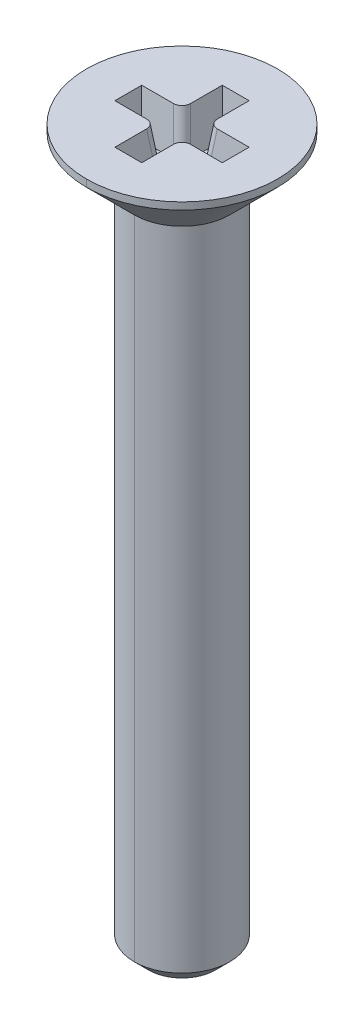
ISO-10303-21;
HEADER;
FILE_DESCRIPTION(('STEP AP214'),'2;1');
FILE_NAME('part.step','',(''),(''),'','','');
FILE_SCHEMA(('AUTOMOTIVE_DESIGN { 1 0 10303 214 1 1 1 1 }'));
ENDSEC;
DATA;
#1=APPLICATION_CONTEXT('core data for automotive mechanical design processes');
#2=APPLICATION_PROTOCOL_DEFINITION('international standard','automotive_design',2000,#1);
#3=PRODUCT_CONTEXT('',#1,'mechanical');
#4=PRODUCT('Part','Part','',(#3));
#5=PRODUCT_RELATED_PRODUCT_CATEGORY('part','',(#4));
#6=PRODUCT_DEFINITION_FORMATION('','',#4);
#7=PRODUCT_DEFINITION_CONTEXT('part definition',#1,'design');
#8=PRODUCT_DEFINITION('design','',#6,#7);
#9=PRODUCT_DEFINITION_SHAPE('','',#8);
#10=(LENGTH_UNIT() NAMED_UNIT(*) SI_UNIT(.MILLI.,.METRE.));
#11=(NAMED_UNIT(*) PLANE_ANGLE_UNIT() SI_UNIT($,.RADIAN.));
#12=(NAMED_UNIT(*) SI_UNIT($,.STERADIAN.) SOLID_ANGLE_UNIT());
#13=UNCERTAINTY_MEASURE_WITH_UNIT(LENGTH_MEASURE(1.E-05),#10,'distance_accuracy_value','');
#14=(GEOMETRIC_REPRESENTATION_CONTEXT(3) GLOBAL_UNCERTAINTY_ASSIGNED_CONTEXT((#13)) GLOBAL_UNIT_ASSIGNED_CONTEXT((#10,
#11,#12)) REPRESENTATION_CONTEXT('',''));
#15=CARTESIAN_POINT('',(0.,0.,0.));
#16=DIRECTION('',(0.,0.,1.));
#17=DIRECTION('',(1.,0.,0.));
#18=AXIS2_PLACEMENT_3D('',#15,#16,#17);
#19=CARTESIAN_POINT('',(-0.937327513708971,2.4151528831535,-0.937327513708973));
#20=DIRECTION('',(-0.120974291151355,0.985256536015293,-0.120974291151355));
#21=DIRECTION('',(0.,0.121869343405148,0.992546151641322));
#22=AXIS2_PLACEMENT_3D('',#19,#20,#21);
#23=CYLINDRICAL_SURFACE('',#22,0.358);
#24=CARTESIAN_POINT('',(-0.3427156359838,0.510000000000022,-0.698047158271395));
#25=CARTESIAN_POINT('',(-0.342715635983799,0.510000000000021,-0.489263624321907));
#26=CARTESIAN_POINT('',(-0.489263624321904,0.510000000000021,-0.342715635983802));
#27=CARTESIAN_POINT('',(-0.698047158271393,0.510000000000022,-0.342715635983802));
#28=(BOUNDED_CURVE() B_SPLINE_CURVE(3,(#24,#25,#26,#27),.UNSPECIFIED.,.F.,
.F.) B_SPLINE_CURVE_WITH_KNOTS((4,4),(2.36362083166487,3.91956447551472),
.UNSPECIFIED.) CURVE() GEOMETRIC_REPRESENTATION_ITEM() RATIONAL_B_SPLINE_CURVE((1.,
0.808225633839927,0.808225633839927,1.)) REPRESENTATION_ITEM(''));
#29=CARTESIAN_POINT('',(-0.3427156359838,0.510000000000022,-0.698047158271395));
#30=VERTEX_POINT('',#29);
#31=CARTESIAN_POINT('',(-0.698047158271393,0.510000000000022,-0.342715635983802));
#32=VERTEX_POINT('',#31);
#33=EDGE_CURVE('E261',#30,#32,#28,.T.);
#34=ORIENTED_EDGE('',*,*,#33,.F.);
#35=DIRECTION('',(0.120974291151355,-0.985256536015293,0.120974291151355));
#36=VECTOR('',#35,1.);
#37=CARTESIAN_POINT('',(-0.3375154376409,0.46764778320126,-0.692846959928494));
#38=LINE('',#37,#36);
#39=CARTESIAN_POINT('',(-0.5625,2.3,-0.917831522287595));
#40=VERTEX_POINT('',#39);
#41=EDGE_CURVE('E262',#40,#30,#38,.T.);
#42=ORIENTED_EDGE('',*,*,#41,.F.);
#43=CARTESIAN_POINT('',(-0.917831522287592,2.3,-0.5625));
#44=CARTESIAN_POINT('',(-0.709047988338105,2.30000000000002,-0.562500000000001));
#45=CARTESIAN_POINT('',(-0.562499999999999,2.30000000000002,-0.709047988338106));
#46=CARTESIAN_POINT('',(-0.5625,2.3,-0.917831522287595));
#47=(BOUNDED_CURVE() B_SPLINE_CURVE(3,(#43,#44,#45,#46),.UNSPECIFIED.,.F.,
.F.) B_SPLINE_CURVE_WITH_KNOTS((4,4),(2.36362083166487,3.91956447551472),
.UNSPECIFIED.) CURVE() GEOMETRIC_REPRESENTATION_ITEM() RATIONAL_B_SPLINE_CURVE((1.,
0.808225633839927,0.808225633839927,1.)) REPRESENTATION_ITEM(''));
#48=CARTESIAN_POINT('',(-0.917831522287592,2.3,-0.5625));
#49=VERTEX_POINT('',#48);
#50=EDGE_CURVE('E307',#49,#40,#47,.T.);
#51=ORIENTED_EDGE('',*,*,#50,.F.);
#52=DIRECTION('',(-0.120974291151355,0.985256536015293,-0.120974291151355));
#53=VECTOR('',#52,1.);
#54=CARTESIAN_POINT('',(-0.912631323944692,2.25764778320126,-0.557299801657101));
#55=LINE('',#54,#53);
#56=EDGE_CURVE('E10',#32,#49,#55,.T.);
#57=ORIENTED_EDGE('',*,*,#56,.F.);
#58=EDGE_LOOP('',(#34,#42,#51,#57));
#59=FACE_BOUND('',#58,.T.);
#60=ADVANCED_FACE('F16',(#59),#23,.T.);
#61=CARTESIAN_POINT('',(-0.871471007670894,1.87879468344341,0.871471007670896));
#62=DIRECTION('',(-0.120974291151355,0.985256536015293,0.120974291151355));
#63=DIRECTION('',(-0.992546151641322,-0.121869343405148,0.));
#64=AXIS2_PLACEMENT_3D('',#61,#62,#63);
#65=CYLINDRICAL_SURFACE('',#64,0.358);
#66=CARTESIAN_POINT('',(-0.698047158271394,0.510000000000022,0.342715635983802));
#67=CARTESIAN_POINT('',(-0.489263624321906,0.510000000000022,0.342715635983801));
#68=CARTESIAN_POINT('',(-0.342715635983801,0.510000000000022,0.489263624321906));
#69=CARTESIAN_POINT('',(-0.342715635983801,0.510000000000022,0.698047158271395));
#70=(BOUNDED_CURVE() B_SPLINE_CURVE(3,(#66,#67,#68,#69),.UNSPECIFIED.,.F.,
.F.) B_SPLINE_CURVE_WITH_KNOTS((4,4),(2.36362083166487,3.91956447551472),
.UNSPECIFIED.) CURVE() GEOMETRIC_REPRESENTATION_ITEM() RATIONAL_B_SPLINE_CURVE((1.,
0.808225633839927,0.808225633839927,1.)) REPRESENTATION_ITEM(''));
#71=CARTESIAN_POINT('',(-0.698047158271394,0.510000000000022,0.342715635983802));
#72=VERTEX_POINT('',#71);
#73=CARTESIAN_POINT('',(-0.342715635983801,0.510000000000022,0.698047158271395));
#74=VERTEX_POINT('',#73);
#75=EDGE_CURVE('E378',#72,#74,#70,.T.);
#76=ORIENTED_EDGE('',*,*,#75,.F.);
#77=DIRECTION('',(0.120974291151355,-0.985256536015293,-0.120974291151355));
#78=VECTOR('',#77,1.);
#79=CARTESIAN_POINT('',(-0.937327513708972,2.45878210809255,0.58199599142138));
#80=LINE('',#79,#78);
#81=CARTESIAN_POINT('',(-0.917831522287593,2.3,0.5625));
#82=VERTEX_POINT('',#81);
#83=EDGE_CURVE('E218',#82,#72,#80,.T.);
#84=ORIENTED_EDGE('',*,*,#83,.F.);
#85=CARTESIAN_POINT('',(-0.5625,2.3,0.917831522287594));
#86=CARTESIAN_POINT('',(-0.5625,2.30000000000002,0.709047988338106));
#87=CARTESIAN_POINT('',(-0.709047988338105,2.30000000000002,0.562500000000001));
#88=CARTESIAN_POINT('',(-0.917831522287593,2.3,0.5625));
#89=(BOUNDED_CURVE() B_SPLINE_CURVE(3,(#85,#86,#87,#88),.UNSPECIFIED.,.F.,
.F.) B_SPLINE_CURVE_WITH_KNOTS((4,4),(2.36362083166487,3.91956447551472),
.UNSPECIFIED.) CURVE() GEOMETRIC_REPRESENTATION_ITEM() RATIONAL_B_SPLINE_CURVE((1.,
0.808225633839927,0.808225633839927,1.)) REPRESENTATION_ITEM(''));
#90=CARTESIAN_POINT('',(-0.5625,2.3,0.917831522287594));
#91=VERTEX_POINT('',#90);
#92=EDGE_CURVE('E292',#91,#82,#89,.T.);
#93=ORIENTED_EDGE('',*,*,#92,.F.);
#94=DIRECTION('',(-0.120974291151355,0.985256536015293,0.120974291151355));
#95=VECTOR('',#94,1.);
#96=CARTESIAN_POINT('',(-0.516139485383301,1.92242390838245,0.871471007670896));
#97=LINE('',#96,#95);
#98=EDGE_CURVE('E350',#74,#91,#97,.T.);
#99=ORIENTED_EDGE('',*,*,#98,.F.);
#100=EDGE_LOOP('',(#76,#84,#93,#99));
#101=FACE_BOUND('',#100,.T.);
#102=ADVANCED_FACE('F18',(#101),#65,.T.);
#103=CARTESIAN_POINT('',(0.871471007670896,1.87879468344341,0.871471007670895));
#104=DIRECTION('',(0.120974291151355,0.985256536015293,0.120974291151355));
#105=DIRECTION('',(-0.992546151641322,0.121869343405148,0.));
#106=AXIS2_PLACEMENT_3D('',#103,#104,#105);
#107=CYLINDRICAL_SURFACE('',#106,0.358);
#108=CARTESIAN_POINT('',(0.342715635983802,0.510000000000022,0.698047158271395));
#109=CARTESIAN_POINT('',(0.342715635983802,0.510000000000022,0.489263624321907));
#110=CARTESIAN_POINT('',(0.489263624321907,0.510000000000022,0.342715635983802));
#111=CARTESIAN_POINT('',(0.698047158271395,0.510000000000022,0.342715635983802));
#112=(BOUNDED_CURVE() B_SPLINE_CURVE(3,(#108,#109,#110,#111),.UNSPECIFIED.,.F.,
.F.) B_SPLINE_CURVE_WITH_KNOTS((4,4),(2.36362083166487,3.91956447551472),
.UNSPECIFIED.) CURVE() GEOMETRIC_REPRESENTATION_ITEM() RATIONAL_B_SPLINE_CURVE((1.,
0.808225633839927,0.808225633839927,1.)) REPRESENTATION_ITEM(''));
#113=CARTESIAN_POINT('',(0.342715635983802,0.510000000000022,0.698047158271395));
#114=VERTEX_POINT('',#113);
#115=CARTESIAN_POINT('',(0.698047158271395,0.510000000000022,0.342715635983802));
#116=VERTEX_POINT('',#115);
#117=EDGE_CURVE('E379',#114,#116,#112,.T.);
#118=ORIENTED_EDGE('',*,*,#117,.F.);
#119=DIRECTION('',(-0.120974291151355,-0.985256536015293,-0.120974291151355));
#120=VECTOR('',#119,1.);
#121=CARTESIAN_POINT('',(0.337515437640901,0.46764778320126,0.692846959928494));
#122=LINE('',#121,#120);
#123=CARTESIAN_POINT('',(0.5625,2.3,0.917831522287594));
#124=VERTEX_POINT('',#123);
#125=EDGE_CURVE('E281',#124,#114,#122,.T.);
#126=ORIENTED_EDGE('',*,*,#125,.F.);
#127=CARTESIAN_POINT('',(0.917831522287594,2.3,0.5625));
#128=CARTESIAN_POINT('',(0.709047988338106,2.30000000000002,0.562500000000001));
#129=CARTESIAN_POINT('',(0.562500000000001,2.30000000000002,0.709047988338106));
#130=CARTESIAN_POINT('',(0.5625,2.3,0.917831522287594));
#131=(BOUNDED_CURVE() B_SPLINE_CURVE(3,(#127,#128,#129,#130),.UNSPECIFIED.,.F.,
.F.) B_SPLINE_CURVE_WITH_KNOTS((4,4),(2.36362083166487,3.91956447551472),
.UNSPECIFIED.) CURVE() GEOMETRIC_REPRESENTATION_ITEM() RATIONAL_B_SPLINE_CURVE((1.,
0.808225633839927,0.808225633839927,1.)) REPRESENTATION_ITEM(''));
#132=CARTESIAN_POINT('',(0.917831522287594,2.3,0.5625));
#133=VERTEX_POINT('',#132);
#134=EDGE_CURVE('E255',#133,#124,#131,.T.);
#135=ORIENTED_EDGE('',*,*,#134,.F.);
#136=DIRECTION('',(0.120974291151355,0.985256536015293,0.120974291151355));
#137=VECTOR('',#136,1.);
#138=CARTESIAN_POINT('',(0.912631323944694,2.25764778320126,0.557299801657101));
#139=LINE('',#138,#137);
#140=EDGE_CURVE('E219',#116,#133,#139,.T.);
#141=ORIENTED_EDGE('',*,*,#140,.F.);
#142=EDGE_LOOP('',(#118,#126,#135,#141));
#143=FACE_BOUND('',#142,.T.);
#144=ADVANCED_FACE('F923',(#143),#107,.T.);
#145=CARTESIAN_POINT('',(0.937327513708973,2.4151528831535,-0.937327513708973));
#146=DIRECTION('',(0.120974291151355,0.985256536015293,-0.120974291151355));
#147=DIRECTION('',(0.,0.121869343405148,0.992546151641322));
#148=AXIS2_PLACEMENT_3D('',#145,#146,#147);
#149=CYLINDRICAL_SURFACE('',#148,0.358);
#150=CARTESIAN_POINT('',(0.698047158271395,0.510000000000022,-0.342715635983802));
#151=CARTESIAN_POINT('',(0.489263624321907,0.510000000000021,-0.342715635983801));
#152=CARTESIAN_POINT('',(0.342715635983801,0.510000000000021,-0.489263624321907));
#153=CARTESIAN_POINT('',(0.342715635983802,0.510000000000022,-0.698047158271395));
#154=(BOUNDED_CURVE() B_SPLINE_CURVE(3,(#150,#151,#152,#153),.UNSPECIFIED.,.F.,
.F.) B_SPLINE_CURVE_WITH_KNOTS((4,4),(2.36362083166487,3.91956447551472),
.UNSPECIFIED.) CURVE() GEOMETRIC_REPRESENTATION_ITEM() RATIONAL_B_SPLINE_CURVE((1.,
0.808225633839927,0.808225633839927,1.)) REPRESENTATION_ITEM(''));
#155=CARTESIAN_POINT('',(0.698047158271395,0.510000000000022,-0.342715635983802));
#156=VERTEX_POINT('',#155);
#157=CARTESIAN_POINT('',(0.342715635983802,0.510000000000022,-0.698047158271395));
#158=VERTEX_POINT('',#157);
#159=EDGE_CURVE('E215',#156,#158,#154,.T.);
#160=ORIENTED_EDGE('',*,*,#159,.F.);
#161=DIRECTION('',(-0.120974291151355,-0.985256536015293,0.120974291151355));
#162=VECTOR('',#161,1.);
#163=CARTESIAN_POINT('',(0.871471007670895,1.92242390838245,-0.516139485383302));
#164=LINE('',#163,#162);
#165=CARTESIAN_POINT('',(0.917831522287594,2.3,-0.5625));
#166=VERTEX_POINT('',#165);
#167=EDGE_CURVE('E38',#166,#156,#164,.T.);
#168=ORIENTED_EDGE('',*,*,#167,.F.);
#169=CARTESIAN_POINT('',(0.5625,2.3,-0.917831522287594));
#170=CARTESIAN_POINT('',(0.562500000000001,2.30000000000002,-0.709047988338106));
#171=CARTESIAN_POINT('',(0.709047988338106,2.30000000000002,-0.562500000000001));
#172=CARTESIAN_POINT('',(0.917831522287594,2.3,-0.5625));
#173=(BOUNDED_CURVE() B_SPLINE_CURVE(3,(#169,#170,#171,#172),.UNSPECIFIED.,.F.,
.F.) B_SPLINE_CURVE_WITH_KNOTS((4,4),(2.36362083166487,3.91956447551472),
.UNSPECIFIED.) CURVE() GEOMETRIC_REPRESENTATION_ITEM() RATIONAL_B_SPLINE_CURVE((1.,
0.808225633839927,0.808225633839927,1.)) REPRESENTATION_ITEM(''));
#174=CARTESIAN_POINT('',(0.5625,2.3,-0.917831522287594));
#175=VERTEX_POINT('',#174);
#176=EDGE_CURVE('E213',#175,#166,#173,.T.);
#177=ORIENTED_EDGE('',*,*,#176,.F.);
#178=DIRECTION('',(0.120974291151355,0.985256536015293,-0.120974291151355));
#179=VECTOR('',#178,1.);
#180=CARTESIAN_POINT('',(0.58199599142138,2.45878210809255,-0.937327513708973));
#181=LINE('',#180,#179);
#182=EDGE_CURVE('E337',#158,#175,#181,.T.);
#183=ORIENTED_EDGE('',*,*,#182,.F.);
#184=EDGE_LOOP('',(#160,#168,#177,#183));
#185=FACE_BOUND('',#184,.T.);
#186=ADVANCED_FACE('F210',(#185),#149,.T.);
#187=CARTESIAN_POINT('',(0.,-27.1,0.));
#188=DIRECTION('',(0.,1.,0.));
#189=DIRECTION('',(0.,0.,1.));
#190=AXIS2_PLACEMENT_3D('',#187,#188,#189);
#191=CONICAL_SURFACE('',#190,2.,0.785398163397457);
#192=DIRECTION('',(0.,0.707106781186542,-0.707106781186554));
#193=VECTOR('',#192,1.);
#194=CARTESIAN_POINT('',(0.,-27.1,-2.));
#195=LINE('',#194,#193);
#196=CARTESIAN_POINT('',(0.,-27.7,-1.4));
#197=VERTEX_POINT('',#196);
#198=CARTESIAN_POINT('',(0.,-27.1,-2.));
#199=VERTEX_POINT('',#198);
#200=EDGE_CURVE('E421',#197,#199,#195,.T.);
#201=ORIENTED_EDGE('',*,*,#200,.F.);
#202=CARTESIAN_POINT('',(0.,-27.7,0.));
#203=DIRECTION('',(0.,-1.,0.));
#204=DIRECTION('',(0.,0.,1.));
#205=AXIS2_PLACEMENT_3D('',#202,#203,#204);
#206=CIRCLE('',#205,1.4);
#207=CARTESIAN_POINT('',(0.,-27.7,1.4));
#208=VERTEX_POINT('',#207);
#209=EDGE_CURVE('E278',#208,#197,#206,.T.);
#210=ORIENTED_EDGE('',*,*,#209,.F.);
#211=DIRECTION('',(0.,0.707106781186542,0.707106781186554));
#212=VECTOR('',#211,1.);
#213=CARTESIAN_POINT('',(0.,-27.1,2.));
#214=LINE('',#213,#212);
#215=CARTESIAN_POINT('',(0.,-27.1,2.));
#216=VERTEX_POINT('',#215);
#217=EDGE_CURVE('E428',#208,#216,#214,.T.);
#218=ORIENTED_EDGE('',*,*,#217,.T.);
#219=CARTESIAN_POINT('',(0.,-27.1,0.));
#220=DIRECTION('',(0.,1.,0.));
#221=DIRECTION('',(0.,0.,1.));
#222=AXIS2_PLACEMENT_3D('',#219,#220,#221);
#223=CIRCLE('',#222,2.);
#224=EDGE_CURVE('E282',#199,#216,#223,.T.);
#225=ORIENTED_EDGE('',*,*,#224,.F.);
#226=EDGE_LOOP('',(#201,#210,#218,#225));
#227=FACE_BOUND('',#226,.T.);
#228=ADVANCED_FACE('F527',(#227),#191,.T.);
#229=CARTESIAN_POINT('',(-2.25,2.3,-0.5625));
#230=DIRECTION('',(0.,-0.121869343405148,-0.992546151641322));
#231=DIRECTION('',(0.,-0.992546151641322,0.121869343405148));
#232=AXIS2_PLACEMENT_3D('',#229,#230,#231);
#233=PLANE('',#232);
#234=DIRECTION('',(1.,0.,0.));
#235=VECTOR('',#234,1.);
#236=CARTESIAN_POINT('',(-2.25,0.510000000000022,-0.342715635983802));
#237=LINE('',#236,#235);
#238=CARTESIAN_POINT('',(-2.0302156359838,0.510000000000022,-0.342715635983802));
#239=VERTEX_POINT('',#238);
#240=EDGE_CURVE('E366',#239,#32,#237,.T.);
#241=ORIENTED_EDGE('',*,*,#240,.T.);
#242=ORIENTED_EDGE('',*,*,#56,.T.);
#243=DIRECTION('',(1.,0.,0.));
#244=VECTOR('',#243,1.);
#245=CARTESIAN_POINT('',(-2.25,2.3,-0.5625));
#246=LINE('',#245,#244);
#247=CARTESIAN_POINT('',(-2.25,2.3,-0.5625));
#248=VERTEX_POINT('',#247);
#249=EDGE_CURVE('E287',#248,#49,#246,.T.);
#250=ORIENTED_EDGE('',*,*,#249,.F.);
#251=DIRECTION('',(-0.120974291151354,0.985256536015293,-0.120974291151355));
#252=VECTOR('',#251,1.);
#253=CARTESIAN_POINT('',(-2.25,2.3,-0.5625));
#254=LINE('',#253,#252);
#255=EDGE_CURVE('E25',#239,#248,#254,.T.);
#256=ORIENTED_EDGE('',*,*,#255,.F.);
#257=EDGE_LOOP('',(#241,#242,#250,#256));
#258=FACE_BOUND('',#257,.T.);
#259=ADVANCED_FACE('F899',(#258),#233,.F.);
#260=CARTESIAN_POINT('',(-2.25,2.3,-0.5625));
#261=DIRECTION('',(-0.992546151641322,-0.121869343405148,0.));
#262=DIRECTION('',(-0.121869343405148,0.992546151641322,0.));
#263=AXIS2_PLACEMENT_3D('',#260,#261,#262);
#264=PLANE('',#263);
#265=DIRECTION('',(0.,0.,1.));
#266=VECTOR('',#265,1.);
#267=CARTESIAN_POINT('',(-2.25,2.3,-0.5625));
#268=LINE('',#267,#266);
#269=CARTESIAN_POINT('',(-2.25,2.3,0.5625));
#270=VERTEX_POINT('',#269);
#271=EDGE_CURVE('E283',#248,#270,#268,.T.);
#272=ORIENTED_EDGE('',*,*,#271,.T.);
#273=DIRECTION('',(-0.120974291151356,0.985256536015293,0.120974291151355));
#274=VECTOR('',#273,1.);
#275=CARTESIAN_POINT('',(-2.23353587349048,2.1659104500725,0.546035873490482));
#276=LINE('',#275,#274);
#277=CARTESIAN_POINT('',(-2.0302156359838,0.510000000000022,0.342715635983802));
#278=VERTEX_POINT('',#277);
#279=EDGE_CURVE('E404',#278,#270,#276,.T.);
#280=ORIENTED_EDGE('',*,*,#279,.F.);
#281=DIRECTION('',(0.,0.,1.));
#282=VECTOR('',#281,1.);
#283=CARTESIAN_POINT('',(-2.0302156359838,0.510000000000022,-0.5625));
#284=LINE('',#283,#282);
#285=EDGE_CURVE('E370',#239,#278,#284,.T.);
#286=ORIENTED_EDGE('',*,*,#285,.F.);
#287=ORIENTED_EDGE('',*,*,#255,.T.);
#288=EDGE_LOOP('',(#272,#280,#286,#287));
#289=FACE_BOUND('',#288,.T.);
#290=ADVANCED_FACE('F774',(#289),#264,.F.);
#291=CARTESIAN_POINT('',(-2.25,2.3,0.5625));
#292=DIRECTION('',(0.,-0.121869343405148,0.992546151641322));
#293=DIRECTION('',(-1.,0.,0.));
#294=AXIS2_PLACEMENT_3D('',#291,#292,#293);
#295=PLANE('',#294);
#296=DIRECTION('',(1.,0.,0.));
#297=VECTOR('',#296,1.);
#298=CARTESIAN_POINT('',(-2.25,2.3,0.5625));
#299=LINE('',#298,#297);
#300=EDGE_CURVE('E288',#270,#82,#299,.T.);
#301=ORIENTED_EDGE('',*,*,#300,.T.);
#302=ORIENTED_EDGE('',*,*,#83,.T.);
#303=DIRECTION('',(1.,0.,0.));
#304=VECTOR('',#303,1.);
#305=CARTESIAN_POINT('',(-2.25,0.510000000000022,0.342715635983802));
#306=LINE('',#305,#304);
#307=EDGE_CURVE('E374',#278,#72,#306,.T.);
#308=ORIENTED_EDGE('',*,*,#307,.F.);
#309=ORIENTED_EDGE('',*,*,#279,.T.);
#310=EDGE_LOOP('',(#301,#302,#308,#309));
#311=FACE_BOUND('',#310,.T.);
#312=ADVANCED_FACE('F770',(#311),#295,.F.);
#313=CARTESIAN_POINT('',(-2.25,2.3,-0.5625));
#314=DIRECTION('',(0.,-0.121869343405148,-0.992546151641322));
#315=DIRECTION('',(0.,-0.992546151641322,0.121869343405148));
#316=AXIS2_PLACEMENT_3D('',#313,#314,#315);
#317=PLANE('',#316);
#318=DIRECTION('',(1.,0.,0.));
#319=VECTOR('',#318,1.);
#320=CARTESIAN_POINT('',(-2.25,2.3,-0.5625));
#321=LINE('',#320,#319);
#322=CARTESIAN_POINT('',(2.25,2.3,-0.5625));
#323=VERTEX_POINT('',#322);
#324=EDGE_CURVE('E222',#166,#323,#321,.T.);
#325=ORIENTED_EDGE('',*,*,#324,.F.);
#326=ORIENTED_EDGE('',*,*,#167,.T.);
#327=DIRECTION('',(1.,0.,0.));
#328=VECTOR('',#327,1.);
#329=CARTESIAN_POINT('',(-2.25,0.510000000000022,-0.342715635983802));
#330=LINE('',#329,#328);
#331=CARTESIAN_POINT('',(2.0302156359838,0.510000000000022,-0.342715635983802));
#332=VERTEX_POINT('',#331);
#333=EDGE_CURVE('E328',#156,#332,#330,.T.);
#334=ORIENTED_EDGE('',*,*,#333,.T.);
#335=DIRECTION('',(0.120974291151354,0.985256536015293,-0.120974291151355));
#336=VECTOR('',#335,1.);
#337=CARTESIAN_POINT('',(2.25,2.3,-0.5625));
#338=LINE('',#337,#336);
#339=EDGE_CURVE('E49',#332,#323,#338,.T.);
#340=ORIENTED_EDGE('',*,*,#339,.T.);
#341=EDGE_LOOP('',(#325,#326,#334,#340));
#342=FACE_BOUND('',#341,.T.);
#343=ADVANCED_FACE('F223',(#342),#317,.F.);
#344=CARTESIAN_POINT('',(-2.25,2.3,0.5625));
#345=DIRECTION('',(0.,-0.121869343405148,0.992546151641322));
#346=DIRECTION('',(-1.,0.,0.));
#347=AXIS2_PLACEMENT_3D('',#344,#345,#346);
#348=PLANE('',#347);
#349=DIRECTION('',(1.,0.,0.));
#350=VECTOR('',#349,1.);
#351=CARTESIAN_POINT('',(-2.25,0.510000000000022,0.342715635983802));
#352=LINE('',#351,#350);
#353=CARTESIAN_POINT('',(2.0302156359838,0.510000000000022,0.342715635983802));
#354=VERTEX_POINT('',#353);
#355=EDGE_CURVE('E385',#116,#354,#352,.T.);
#356=ORIENTED_EDGE('',*,*,#355,.F.);
#357=ORIENTED_EDGE('',*,*,#140,.T.);
#358=DIRECTION('',(1.,0.,0.));
#359=VECTOR('',#358,1.);
#360=CARTESIAN_POINT('',(-2.25,2.3,0.5625));
#361=LINE('',#360,#359);
#362=CARTESIAN_POINT('',(2.25,2.3,0.5625));
#363=VERTEX_POINT('',#362);
#364=EDGE_CURVE('E265',#133,#363,#361,.T.);
#365=ORIENTED_EDGE('',*,*,#364,.T.);
#366=DIRECTION('',(0.120974291151355,0.985256536015293,0.120974291151355));
#367=VECTOR('',#366,1.);
#368=CARTESIAN_POINT('',(2.23353587349048,2.1659104500725,0.546035873490482));
#369=LINE('',#368,#367);
#370=EDGE_CURVE('E399',#354,#363,#369,.T.);
#371=ORIENTED_EDGE('',*,*,#370,.F.);
#372=EDGE_LOOP('',(#356,#357,#365,#371));
#373=FACE_BOUND('',#372,.T.);
#374=ADVANCED_FACE('F868',(#373),#348,.F.);
#375=CARTESIAN_POINT('',(2.25,2.3,-0.5625));
#376=DIRECTION('',(0.992546151641322,-0.121869343405148,0.));
#377=DIRECTION('',(0.,0.,-1.));
#378=AXIS2_PLACEMENT_3D('',#375,#376,#377);
#379=PLANE('',#378);
#380=DIRECTION('',(0.,0.,1.));
#381=VECTOR('',#380,1.);
#382=CARTESIAN_POINT('',(2.25,2.3,-0.5625));
#383=LINE('',#382,#381);
#384=EDGE_CURVE('E227',#323,#363,#383,.T.);
#385=ORIENTED_EDGE('',*,*,#384,.F.);
#386=ORIENTED_EDGE('',*,*,#339,.F.);
#387=DIRECTION('',(0.,0.,1.));
#388=VECTOR('',#387,1.);
#389=CARTESIAN_POINT('',(2.0302156359838,0.510000000000022,-0.5625));
#390=LINE('',#389,#388);
#391=EDGE_CURVE('E392',#332,#354,#390,.T.);
#392=ORIENTED_EDGE('',*,*,#391,.T.);
#393=ORIENTED_EDGE('',*,*,#370,.T.);
#394=EDGE_LOOP('',(#385,#386,#392,#393));
#395=FACE_BOUND('',#394,.T.);
#396=ADVANCED_FACE('F859',(#395),#379,.F.);
#397=CARTESIAN_POINT('',(0.5625,0.510000000000022,-2.25));
#398=DIRECTION('',(0.,-1.,0.));
#399=DIRECTION('',(0.,0.,-1.));
#400=AXIS2_PLACEMENT_3D('',#397,#398,#399);
#401=PLANE('',#400);
#402=DIRECTION('',(0.,0.,1.));
#403=VECTOR('',#402,1.);
#404=CARTESIAN_POINT('',(0.342715635983801,0.510000000000022,-2.25));
#405=LINE('',#404,#403);
#406=CARTESIAN_POINT('',(0.342715635983801,0.510000000000022,-2.0302156359838));
#407=VERTEX_POINT('',#406);
#408=EDGE_CURVE('E363',#407,#158,#405,.T.);
#409=ORIENTED_EDGE('',*,*,#408,.F.);
#410=DIRECTION('',(1.,0.,0.));
#411=VECTOR('',#410,1.);
#412=CARTESIAN_POINT('',(-0.5625,0.510000000000022,-2.0302156359838));
#413=LINE('',#412,#411);
#414=CARTESIAN_POINT('',(-0.3427156359838,0.510000000000022,-2.0302156359838));
#415=VERTEX_POINT('',#414);
#416=EDGE_CURVE('E356',#415,#407,#413,.T.);
#417=ORIENTED_EDGE('',*,*,#416,.F.);
#418=DIRECTION('',(0.,0.,1.));
#419=VECTOR('',#418,1.);
#420=CARTESIAN_POINT('',(-0.3427156359838,0.510000000000022,-2.25));
#421=LINE('',#420,#419);
#422=EDGE_CURVE('E257',#415,#30,#421,.T.);
#423=ORIENTED_EDGE('',*,*,#422,.T.);
#424=ORIENTED_EDGE('',*,*,#33,.T.);
#425=ORIENTED_EDGE('',*,*,#240,.F.);
#426=ORIENTED_EDGE('',*,*,#285,.T.);
#427=ORIENTED_EDGE('',*,*,#307,.T.);
#428=ORIENTED_EDGE('',*,*,#75,.T.);
#429=DIRECTION('',(0.,0.,1.));
#430=VECTOR('',#429,1.);
#431=CARTESIAN_POINT('',(-0.3427156359838,0.510000000000022,-2.25));
#432=LINE('',#431,#430);
#433=CARTESIAN_POINT('',(-0.342715635983801,0.510000000000022,2.0302156359838));
#434=VERTEX_POINT('',#433);
#435=EDGE_CURVE('E346',#74,#434,#432,.T.);
#436=ORIENTED_EDGE('',*,*,#435,.T.);
#437=DIRECTION('',(1.,0.,0.));
#438=VECTOR('',#437,1.);
#439=CARTESIAN_POINT('',(-0.5625,0.510000000000022,2.0302156359838));
#440=LINE('',#439,#438);
#441=CARTESIAN_POINT('',(0.342715635983802,0.510000000000022,2.0302156359838));
#442=VERTEX_POINT('',#441);
#443=EDGE_CURVE('E347',#434,#442,#440,.T.);
#444=ORIENTED_EDGE('',*,*,#443,.T.);
#445=DIRECTION('',(0.,0.,1.));
#446=VECTOR('',#445,1.);
#447=CARTESIAN_POINT('',(0.342715635983801,0.510000000000022,-2.25));
#448=LINE('',#447,#446);
#449=EDGE_CURVE('E308',#114,#442,#448,.T.);
#450=ORIENTED_EDGE('',*,*,#449,.F.);
#451=ORIENTED_EDGE('',*,*,#117,.T.);
#452=ORIENTED_EDGE('',*,*,#355,.T.);
#453=ORIENTED_EDGE('',*,*,#391,.F.);
#454=ORIENTED_EDGE('',*,*,#333,.F.);
#455=ORIENTED_EDGE('',*,*,#159,.T.);
#456=EDGE_LOOP('',(#409,#417,#423,#424,#425,#426,#427,#428,#436,#444,#450,#451,#452,#453,#454,#455));
#457=FACE_BOUND('',#456,.T.);
#458=ADVANCED_FACE('F842',(#457),#401,.F.);
#459=CARTESIAN_POINT('',(-0.5625,2.3,-2.25));
#460=DIRECTION('',(-0.992546151641322,-0.121869343405148,0.));
#461=DIRECTION('',(-0.121869343405148,0.992546151641322,0.));
#462=AXIS2_PLACEMENT_3D('',#459,#460,#461);
#463=PLANE('',#462);
#464=DIRECTION('',(0.,0.,1.));
#465=VECTOR('',#464,1.);
#466=CARTESIAN_POINT('',(-0.5625,2.3,-2.25));
#467=LINE('',#466,#465);
#468=CARTESIAN_POINT('',(-0.5625,2.3,-2.25));
#469=VERTEX_POINT('',#468);
#470=EDGE_CURVE('E273',#469,#40,#467,.T.);
#471=ORIENTED_EDGE('',*,*,#470,.T.);
#472=ORIENTED_EDGE('',*,*,#41,.T.);
#473=ORIENTED_EDGE('',*,*,#422,.F.);
#474=DIRECTION('',(-0.120974291151355,0.985256536015293,-0.120974291151355));
#475=VECTOR('',#474,1.);
#476=CARTESIAN_POINT('',(-0.5625,2.3,-2.25));
#477=LINE('',#476,#475);
#478=EDGE_CURVE('E353',#415,#469,#477,.T.);
#479=ORIENTED_EDGE('',*,*,#478,.T.);
#480=EDGE_LOOP('',(#471,#472,#473,#479));
#481=FACE_BOUND('',#480,.T.);
#482=ADVANCED_FACE('F733',(#481),#463,.F.);
#483=CARTESIAN_POINT('',(0.5625,2.3,-2.25));
#484=DIRECTION('',(0.992546151641322,-0.121869343405148,0.));
#485=DIRECTION('',(0.,0.,-1.));
#486=AXIS2_PLACEMENT_3D('',#483,#484,#485);
#487=PLANE('',#486);
#488=ORIENTED_EDGE('',*,*,#408,.T.);
#489=ORIENTED_EDGE('',*,*,#182,.T.);
#490=DIRECTION('',(0.,0.,1.));
#491=VECTOR('',#490,1.);
#492=CARTESIAN_POINT('',(0.5625,2.3,-2.25));
#493=LINE('',#492,#491);
#494=CARTESIAN_POINT('',(0.5625,2.3,-2.25));
#495=VERTEX_POINT('',#494);
#496=EDGE_CURVE('E233',#495,#175,#493,.T.);
#497=ORIENTED_EDGE('',*,*,#496,.F.);
#498=DIRECTION('',(0.120974291151355,0.985256536015293,-0.120974291151355));
#499=VECTOR('',#498,1.);
#500=CARTESIAN_POINT('',(0.5625,2.3,-2.25));
#501=LINE('',#500,#499);
#502=EDGE_CURVE('E360',#407,#495,#501,.T.);
#503=ORIENTED_EDGE('',*,*,#502,.F.);
#504=EDGE_LOOP('',(#488,#489,#497,#503));
#505=FACE_BOUND('',#504,.T.);
#506=ADVANCED_FACE('F728',(#505),#487,.F.);
#507=CARTESIAN_POINT('',(-0.5625,2.3,-2.25));
#508=DIRECTION('',(0.,-0.121869343405148,-0.992546151641322));
#509=DIRECTION('',(0.,-0.992546151641322,0.121869343405148));
#510=AXIS2_PLACEMENT_3D('',#507,#508,#509);
#511=PLANE('',#510);
#512=DIRECTION('',(1.,0.,0.));
#513=VECTOR('',#512,1.);
#514=CARTESIAN_POINT('',(-0.5625,2.3,-2.25));
#515=LINE('',#514,#513);
#516=EDGE_CURVE('E269',#469,#495,#515,.T.);
#517=ORIENTED_EDGE('',*,*,#516,.F.);
#518=ORIENTED_EDGE('',*,*,#478,.F.);
#519=ORIENTED_EDGE('',*,*,#416,.T.);
#520=ORIENTED_EDGE('',*,*,#502,.T.);
#521=EDGE_LOOP('',(#517,#518,#519,#520));
#522=FACE_BOUND('',#521,.T.);
#523=ADVANCED_FACE('F732',(#522),#511,.F.);
#524=CARTESIAN_POINT('',(-0.5625,2.3,-2.25));
#525=DIRECTION('',(-0.992546151641322,-0.121869343405148,0.));
#526=DIRECTION('',(-0.121869343405148,0.992546151641322,0.));
#527=AXIS2_PLACEMENT_3D('',#524,#525,#526);
#528=PLANE('',#527);
#529=ORIENTED_EDGE('',*,*,#435,.F.);
#530=ORIENTED_EDGE('',*,*,#98,.T.);
#531=DIRECTION('',(0.,0.,1.));
#532=VECTOR('',#531,1.);
#533=CARTESIAN_POINT('',(-0.5625,2.3,-2.25));
#534=LINE('',#533,#532);
#535=CARTESIAN_POINT('',(-0.5625,2.3,2.25));
#536=VERTEX_POINT('',#535);
#537=EDGE_CURVE('E277',#91,#536,#534,.T.);
#538=ORIENTED_EDGE('',*,*,#537,.T.);
#539=DIRECTION('',(-0.120974291151355,0.985256536015293,0.120974291151355));
#540=VECTOR('',#539,1.);
#541=CARTESIAN_POINT('',(-0.496643493961923,1.76364180028992,2.18414349396192));
#542=LINE('',#541,#540);
#543=EDGE_CURVE('E343',#434,#536,#542,.T.);
#544=ORIENTED_EDGE('',*,*,#543,.F.);
#545=EDGE_LOOP('',(#529,#530,#538,#544));
#546=FACE_BOUND('',#545,.T.);
#547=ADVANCED_FACE('F739',(#546),#528,.F.);
#548=CARTESIAN_POINT('',(-0.5625,2.3,2.25));
#549=DIRECTION('',(0.,-0.121869343405148,0.992546151641322));
#550=DIRECTION('',(-1.,0.,0.));
#551=AXIS2_PLACEMENT_3D('',#548,#549,#550);
#552=PLANE('',#551);
#553=DIRECTION('',(1.,0.,0.));
#554=VECTOR('',#553,1.);
#555=CARTESIAN_POINT('',(-0.5625,2.3,2.25));
#556=LINE('',#555,#554);
#557=CARTESIAN_POINT('',(0.5625,2.3,2.25));
#558=VERTEX_POINT('',#557);
#559=EDGE_CURVE('E254',#536,#558,#556,.T.);
#560=ORIENTED_EDGE('',*,*,#559,.T.);
#561=DIRECTION('',(0.120974291151355,0.985256536015293,0.120974291151355));
#562=VECTOR('',#561,1.);
#563=CARTESIAN_POINT('',(0.496643493961924,1.76364180028992,2.18414349396192));
#564=LINE('',#563,#562);
#565=EDGE_CURVE('E312',#442,#558,#564,.T.);
#566=ORIENTED_EDGE('',*,*,#565,.F.);
#567=ORIENTED_EDGE('',*,*,#443,.F.);
#568=ORIENTED_EDGE('',*,*,#543,.T.);
#569=EDGE_LOOP('',(#560,#566,#567,#568));
#570=FACE_BOUND('',#569,.T.);
#571=ADVANCED_FACE('F743',(#570),#552,.F.);
#572=CARTESIAN_POINT('',(0.5625,2.3,-2.25));
#573=DIRECTION('',(0.992546151641322,-0.121869343405148,0.));
#574=DIRECTION('',(0.,0.,-1.));
#575=AXIS2_PLACEMENT_3D('',#572,#573,#574);
#576=PLANE('',#575);
#577=DIRECTION('',(0.,0.,1.));
#578=VECTOR('',#577,1.);
#579=CARTESIAN_POINT('',(0.5625,2.3,-2.25));
#580=LINE('',#579,#578);
#581=EDGE_CURVE('E249',#124,#558,#580,.T.);
#582=ORIENTED_EDGE('',*,*,#581,.F.);
#583=ORIENTED_EDGE('',*,*,#125,.T.);
#584=ORIENTED_EDGE('',*,*,#449,.T.);
#585=ORIENTED_EDGE('',*,*,#565,.T.);
#586=EDGE_LOOP('',(#582,#583,#584,#585));
#587=FACE_BOUND('',#586,.T.);
#588=ADVANCED_FACE('F796',(#587),#576,.F.);
#589=CARTESIAN_POINT('',(2.,-27.7,0.));
#590=DIRECTION('',(0.,1.,0.));
#591=DIRECTION('',(1.,0.,0.));
#592=AXIS2_PLACEMENT_3D('',#589,#590,#591);
#593=PLANE('',#592);
#594=ORIENTED_EDGE('',*,*,#209,.T.);
#595=CARTESIAN_POINT('',(0.,-27.7,0.));
#596=DIRECTION('',(0.,-1.,0.));
#597=DIRECTION('',(0.,0.,1.));
#598=AXIS2_PLACEMENT_3D('',#595,#596,#597);
#599=CIRCLE('',#598,1.4);
#600=EDGE_CURVE('E420',#197,#208,#599,.T.);
#601=ORIENTED_EDGE('',*,*,#600,.T.);
#602=EDGE_LOOP('',(#594,#601));
#603=FACE_BOUND('',#602,.T.);
#604=ADVANCED_FACE('F819',(#603),#593,.F.);
#605=CARTESIAN_POINT('',(0.,1.98375015365526,0.));
#606=DIRECTION('',(0.,1.,0.));
#607=DIRECTION('',(0.,0.,1.));
#608=AXIS2_PLACEMENT_3D('',#605,#606,#607);
#609=CYLINDRICAL_SURFACE('',#608,2.);
#610=DIRECTION('',(0.,1.,0.));
#611=VECTOR('',#610,1.);
#612=CARTESIAN_POINT('',(0.,1.98375015365526,-2.));
#613=LINE('',#612,#611);
#614=CARTESIAN_POINT('',(0.,0.,-2.));
#615=VERTEX_POINT('',#614);
#616=EDGE_CURVE('E439',#199,#615,#613,.T.);
#617=ORIENTED_EDGE('',*,*,#616,.F.);
#618=ORIENTED_EDGE('',*,*,#224,.T.);
#619=DIRECTION('',(0.,1.,0.));
#620=VECTOR('',#619,1.);
#621=CARTESIAN_POINT('',(0.,1.98375015365526,2.));
#622=LINE('',#621,#620);
#623=CARTESIAN_POINT('',(0.,0.,2.));
#624=VERTEX_POINT('',#623);
#625=EDGE_CURVE('E470',#216,#624,#622,.T.);
#626=ORIENTED_EDGE('',*,*,#625,.T.);
#627=CARTESIAN_POINT('',(0.,0.,0.));
#628=DIRECTION('',(0.,1.,0.));
#629=DIRECTION('',(0.,0.,1.));
#630=AXIS2_PLACEMENT_3D('',#627,#628,#629);
#631=CIRCLE('',#630,2.);
#632=EDGE_CURVE('E323',#615,#624,#631,.T.);
#633=ORIENTED_EDGE('',*,*,#632,.F.);
#634=EDGE_LOOP('',(#617,#618,#626,#633));
#635=FACE_BOUND('',#634,.T.);
#636=ADVANCED_FACE('F523',(#635),#609,.T.);
#637=CARTESIAN_POINT('',(0.,0.,0.));
#638=DIRECTION('',(0.,1.,0.));
#639=DIRECTION('',(0.,0.,1.));
#640=AXIS2_PLACEMENT_3D('',#637,#638,#639);
#641=CONICAL_SURFACE('',#640,2.,0.785398163397443);
#642=DIRECTION('',(0.,0.707106781186552,-0.707106781186544));
#643=VECTOR('',#642,1.);
#644=CARTESIAN_POINT('',(0.,0.,-2.));
#645=LINE('',#644,#643);
#646=CARTESIAN_POINT('',(0.,2.,-4.));
#647=VERTEX_POINT('',#646);
#648=EDGE_CURVE('E462',#615,#647,#645,.T.);
#649=ORIENTED_EDGE('',*,*,#648,.F.);
#650=ORIENTED_EDGE('',*,*,#632,.T.);
#651=DIRECTION('',(0.,0.707106781186552,0.707106781186544));
#652=VECTOR('',#651,1.);
#653=CARTESIAN_POINT('',(0.,0.,2.));
#654=LINE('',#653,#652);
#655=CARTESIAN_POINT('',(0.,2.,4.));
#656=VERTEX_POINT('',#655);
#657=EDGE_CURVE('E433',#624,#656,#654,.T.);
#658=ORIENTED_EDGE('',*,*,#657,.T.);
#659=CARTESIAN_POINT('',(0.,2.,0.));
#660=DIRECTION('',(0.,1.,0.));
#661=DIRECTION('',(0.,0.,1.));
#662=AXIS2_PLACEMENT_3D('',#659,#660,#661);
#663=CIRCLE('',#662,4.);
#664=EDGE_CURVE('E272',#647,#656,#663,.T.);
#665=ORIENTED_EDGE('',*,*,#664,.F.);
#666=EDGE_LOOP('',(#649,#650,#658,#665));
#667=FACE_BOUND('',#666,.T.);
#668=ADVANCED_FACE('F513',(#667),#641,.T.);
#669=CARTESIAN_POINT('',(0.,1.98375015365526,0.));
#670=DIRECTION('',(0.,1.,0.));
#671=DIRECTION('',(0.,0.,1.));
#672=AXIS2_PLACEMENT_3D('',#669,#670,#671);
#673=CYLINDRICAL_SURFACE('',#672,4.);
#674=DIRECTION('',(0.,1.,0.));
#675=VECTOR('',#674,1.);
#676=CARTESIAN_POINT('',(0.,1.98375015365526,-4.));
#677=LINE('',#676,#675);
#678=CARTESIAN_POINT('',(0.,2.3,-4.));
#679=VERTEX_POINT('',#678);
#680=EDGE_CURVE('E429',#647,#679,#677,.T.);
#681=ORIENTED_EDGE('',*,*,#680,.F.);
#682=ORIENTED_EDGE('',*,*,#664,.T.);
#683=DIRECTION('',(0.,1.,0.));
#684=VECTOR('',#683,1.);
#685=CARTESIAN_POINT('',(0.,1.98375015365526,4.));
#686=LINE('',#685,#684);
#687=CARTESIAN_POINT('',(0.,2.3,4.));
#688=VERTEX_POINT('',#687);
#689=EDGE_CURVE('E442',#656,#688,#686,.T.);
#690=ORIENTED_EDGE('',*,*,#689,.T.);
#691=CARTESIAN_POINT('',(0.,2.3,0.));
#692=DIRECTION('',(0.,1.,0.));
#693=DIRECTION('',(0.,0.,1.));
#694=AXIS2_PLACEMENT_3D('',#691,#692,#693);
#695=CIRCLE('',#694,4.);
#696=EDGE_CURVE('E241',#679,#688,#695,.T.);
#697=ORIENTED_EDGE('',*,*,#696,.F.);
#698=EDGE_LOOP('',(#681,#682,#690,#697));
#699=FACE_BOUND('',#698,.T.);
#700=ADVANCED_FACE('F509',(#699),#673,.T.);
#701=CARTESIAN_POINT('',(0.,2.3,0.));
#702=DIRECTION('',(0.,-1.,0.));
#703=DIRECTION('',(0.,0.,-1.));
#704=AXIS2_PLACEMENT_3D('',#701,#702,#703);
#705=PLANE('',#704);
#706=ORIENTED_EDGE('',*,*,#496,.T.);
#707=ORIENTED_EDGE('',*,*,#176,.T.);
#708=ORIENTED_EDGE('',*,*,#324,.T.);
#709=ORIENTED_EDGE('',*,*,#384,.T.);
#710=ORIENTED_EDGE('',*,*,#364,.F.);
#711=ORIENTED_EDGE('',*,*,#134,.T.);
#712=ORIENTED_EDGE('',*,*,#581,.T.);
#713=ORIENTED_EDGE('',*,*,#559,.F.);
#714=ORIENTED_EDGE('',*,*,#537,.F.);
#715=ORIENTED_EDGE('',*,*,#92,.T.);
#716=ORIENTED_EDGE('',*,*,#300,.F.);
#717=ORIENTED_EDGE('',*,*,#271,.F.);
#718=ORIENTED_EDGE('',*,*,#249,.T.);
#719=ORIENTED_EDGE('',*,*,#50,.T.);
#720=ORIENTED_EDGE('',*,*,#470,.F.);
#721=ORIENTED_EDGE('',*,*,#516,.T.);
#722=EDGE_LOOP('',(#706,#707,#708,#709,#710,#711,#712,#713,#714,#715,#716,#717,#718,#719,#720,#721));
#723=FACE_BOUND('',#722,.T.);
#724=CARTESIAN_POINT('',(0.,2.3,0.));
#725=DIRECTION('',(0.,1.,0.));
#726=DIRECTION('',(0.,0.,1.));
#727=AXIS2_PLACEMENT_3D('',#724,#725,#726);
#728=CIRCLE('',#727,4.);
#729=EDGE_CURVE('E247',#688,#679,#728,.T.);
#730=ORIENTED_EDGE('',*,*,#729,.T.);
#731=ORIENTED_EDGE('',*,*,#696,.T.);
#732=EDGE_LOOP('',(#730,#731));
#733=FACE_BOUND('',#732,.T.);
#734=ADVANCED_FACE('F229',(#723,#733),#705,.F.);
#735=CARTESIAN_POINT('',(0.,1.98375015365526,0.));
#736=DIRECTION('',(0.,1.,0.));
#737=DIRECTION('',(0.,0.,1.));
#738=AXIS2_PLACEMENT_3D('',#735,#736,#737);
#739=CYLINDRICAL_SURFACE('',#738,4.);
#740=CARTESIAN_POINT('',(0.,2.,0.));
#741=DIRECTION('',(0.,1.,0.));
#742=DIRECTION('',(0.,0.,1.));
#743=AXIS2_PLACEMENT_3D('',#740,#741,#742);
#744=CIRCLE('',#743,4.);
#745=EDGE_CURVE('E469',#656,#647,#744,.T.);
#746=ORIENTED_EDGE('',*,*,#745,.T.);
#747=ORIENTED_EDGE('',*,*,#680,.T.);
#748=ORIENTED_EDGE('',*,*,#729,.F.);
#749=ORIENTED_EDGE('',*,*,#689,.F.);
#750=EDGE_LOOP('',(#746,#747,#748,#749));
#751=FACE_BOUND('',#750,.T.);
#752=ADVANCED_FACE('F507',(#751),#739,.T.);
#753=CARTESIAN_POINT('',(0.,0.,0.));
#754=DIRECTION('',(0.,1.,0.));
#755=DIRECTION('',(0.,0.,1.));
#756=AXIS2_PLACEMENT_3D('',#753,#754,#755);
#757=CONICAL_SURFACE('',#756,2.,0.785398163397443);
#758=CARTESIAN_POINT('',(0.,0.,0.));
#759=DIRECTION('',(0.,1.,0.));
#760=DIRECTION('',(0.,0.,1.));
#761=AXIS2_PLACEMENT_3D('',#758,#759,#760);
#762=CIRCLE('',#761,2.);
#763=EDGE_CURVE('E453',#624,#615,#762,.T.);
#764=ORIENTED_EDGE('',*,*,#763,.T.);
#765=ORIENTED_EDGE('',*,*,#648,.T.);
#766=ORIENTED_EDGE('',*,*,#745,.F.);
#767=ORIENTED_EDGE('',*,*,#657,.F.);
#768=EDGE_LOOP('',(#764,#765,#766,#767));
#769=FACE_BOUND('',#768,.T.);
#770=ADVANCED_FACE('F515',(#769),#757,.T.);
#771=CARTESIAN_POINT('',(0.,1.98375015365526,0.));
#772=DIRECTION('',(0.,1.,0.));
#773=DIRECTION('',(0.,0.,1.));
#774=AXIS2_PLACEMENT_3D('',#771,#772,#773);
#775=CYLINDRICAL_SURFACE('',#774,2.);
#776=CARTESIAN_POINT('',(0.,-27.1,0.));
#777=DIRECTION('',(0.,1.,0.));
#778=DIRECTION('',(0.,0.,1.));
#779=AXIS2_PLACEMENT_3D('',#776,#777,#778);
#780=CIRCLE('',#779,2.);
#781=EDGE_CURVE('E424',#216,#199,#780,.T.);
#782=ORIENTED_EDGE('',*,*,#781,.T.);
#783=ORIENTED_EDGE('',*,*,#616,.T.);
#784=ORIENTED_EDGE('',*,*,#763,.F.);
#785=ORIENTED_EDGE('',*,*,#625,.F.);
#786=EDGE_LOOP('',(#782,#783,#784,#785));
#787=FACE_BOUND('',#786,.T.);
#788=ADVANCED_FACE('F520',(#787),#775,.T.);
#789=CARTESIAN_POINT('',(0.,-27.1,0.));
#790=DIRECTION('',(0.,1.,0.));
#791=DIRECTION('',(0.,0.,1.));
#792=AXIS2_PLACEMENT_3D('',#789,#790,#791);
#793=CONICAL_SURFACE('',#792,2.,0.785398163397457);
#794=ORIENTED_EDGE('',*,*,#600,.F.);
#795=ORIENTED_EDGE('',*,*,#200,.T.);
#796=ORIENTED_EDGE('',*,*,#781,.F.);
#797=ORIENTED_EDGE('',*,*,#217,.F.);
#798=EDGE_LOOP('',(#794,#795,#796,#797));
#799=FACE_BOUND('',#798,.T.);
#800=ADVANCED_FACE('F531',(#799),#793,.T.);
#801=CLOSED_SHELL('',(#60,#102,#144,#186,#228,#259,#290,#312,#343,#374,#396,#458,#482,#506,#523,
#547,#571,#588,#604,#636,#668,#700,#734,#752,#770,#788,#800));
#802=MANIFOLD_SOLID_BREP('B1',#801);
#803=ADVANCED_BREP_SHAPE_REPRESENTATION('',(#18,#802),#14);
#804=SHAPE_DEFINITION_REPRESENTATION(#9,#803);
ENDSEC;
END-ISO-10303-21;
